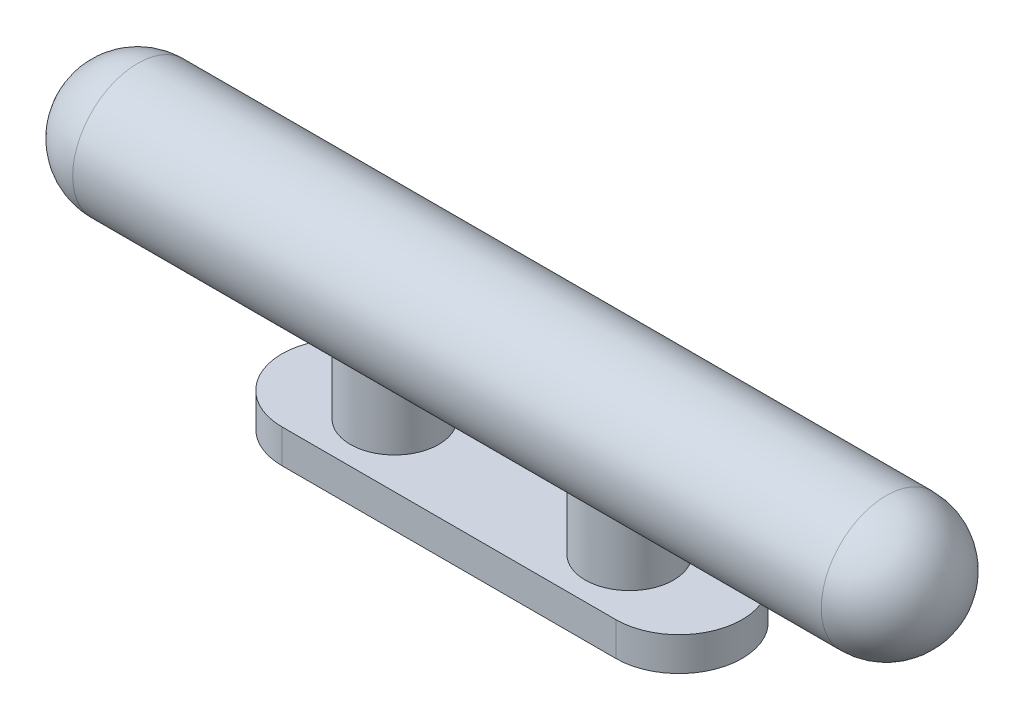
ISO-10303-21;
HEADER;
FILE_DESCRIPTION(('STEP AP214'),'2;1');
FILE_NAME('part.step','',(''),(''),'','','');
FILE_SCHEMA(('AUTOMOTIVE_DESIGN { 1 0 10303 214 1 1 1 1 }'));
ENDSEC;
DATA;
#1=APPLICATION_CONTEXT('core data for automotive mechanical design processes');
#2=APPLICATION_PROTOCOL_DEFINITION('international standard','automotive_design',2000,#1);
#3=PRODUCT_CONTEXT('',#1,'mechanical');
#4=PRODUCT('Part','Part','',(#3));
#5=PRODUCT_RELATED_PRODUCT_CATEGORY('part','',(#4));
#6=PRODUCT_DEFINITION_FORMATION('','',#4);
#7=PRODUCT_DEFINITION_CONTEXT('part definition',#1,'design');
#8=PRODUCT_DEFINITION('design','',#6,#7);
#9=PRODUCT_DEFINITION_SHAPE('','',#8);
#10=(LENGTH_UNIT() NAMED_UNIT(*) SI_UNIT(.MILLI.,.METRE.));
#11=(NAMED_UNIT(*) PLANE_ANGLE_UNIT() SI_UNIT($,.RADIAN.));
#12=(NAMED_UNIT(*) SI_UNIT($,.STERADIAN.) SOLID_ANGLE_UNIT());
#13=UNCERTAINTY_MEASURE_WITH_UNIT(LENGTH_MEASURE(1.E-05),#10,'distance_accuracy_value','');
#14=(GEOMETRIC_REPRESENTATION_CONTEXT(3) GLOBAL_UNCERTAINTY_ASSIGNED_CONTEXT((#13)) GLOBAL_UNIT_ASSIGNED_CONTEXT((#10,
#11,#12)) REPRESENTATION_CONTEXT('',''));
#15=CARTESIAN_POINT('',(0.,0.,0.));
#16=DIRECTION('',(0.,0.,1.));
#17=DIRECTION('',(1.,0.,0.));
#18=AXIS2_PLACEMENT_3D('',#15,#16,#17);
#19=CARTESIAN_POINT('',(0.,5.842,0.));
#20=DIRECTION('',(0.,-1.,0.));
#21=DIRECTION('',(0.,0.,-1.));
#22=AXIS2_PLACEMENT_3D('',#19,#20,#21);
#23=CYLINDRICAL_SURFACE('',#22,10.95375);
#24=CARTESIAN_POINT('',(0.,0.,0.));
#25=DIRECTION('',(0.,1.,0.));
#26=DIRECTION('',(0.,0.,1.));
#27=AXIS2_PLACEMENT_3D('',#24,#25,#26);
#28=CIRCLE('',#27,10.95375);
#29=CARTESIAN_POINT('',(0.,0.,-10.95375));
#30=VERTEX_POINT('',#29);
#31=CARTESIAN_POINT('',(0.,0.,10.95375));
#32=VERTEX_POINT('',#31);
#33=EDGE_CURVE('E104',#30,#32,#28,.T.);
#34=ORIENTED_EDGE('',*,*,#33,.T.);
#35=DIRECTION('',(0.,-1.,0.));
#36=VECTOR('',#35,1.);
#37=CARTESIAN_POINT('',(0.,5.842,10.95375));
#38=LINE('',#37,#36);
#39=CARTESIAN_POINT('',(0.,5.842,10.95375));
#40=VERTEX_POINT('',#39);
#41=EDGE_CURVE('E11',#40,#32,#38,.T.);
#42=ORIENTED_EDGE('',*,*,#41,.F.);
#43=CARTESIAN_POINT('',(0.,5.842,0.));
#44=DIRECTION('',(0.,1.,0.));
#45=DIRECTION('',(0.,0.,1.));
#46=AXIS2_PLACEMENT_3D('',#43,#44,#45);
#47=CIRCLE('',#46,10.95375);
#48=CARTESIAN_POINT('',(0.,5.842,-10.95375));
#49=VERTEX_POINT('',#48);
#50=EDGE_CURVE('E91',#49,#40,#47,.T.);
#51=ORIENTED_EDGE('',*,*,#50,.F.);
#52=DIRECTION('',(0.,-1.,0.));
#53=VECTOR('',#52,1.);
#54=CARTESIAN_POINT('',(0.,5.842,-10.95375));
#55=LINE('',#54,#53);
#56=EDGE_CURVE('E100',#49,#30,#55,.T.);
#57=ORIENTED_EDGE('',*,*,#56,.T.);
#58=EDGE_LOOP('',(#34,#42,#51,#57));
#59=FACE_BOUND('',#58,.T.);
#60=ADVANCED_FACE('F34',(#59),#23,.T.);
#61=CARTESIAN_POINT('',(0.,5.842,10.95375));
#62=DIRECTION('',(0.,0.,-1.));
#63=DIRECTION('',(-1.,0.,0.));
#64=AXIS2_PLACEMENT_3D('',#61,#62,#63);
#65=PLANE('',#64);
#66=DIRECTION('',(1.,0.,0.));
#67=VECTOR('',#66,1.);
#68=CARTESIAN_POINT('',(0.,0.,10.95375));
#69=LINE('',#68,#67);
#70=CARTESIAN_POINT('',(57.9374,0.,10.95375));
#71=VERTEX_POINT('',#70);
#72=EDGE_CURVE('E95',#32,#71,#69,.T.);
#73=ORIENTED_EDGE('',*,*,#72,.T.);
#74=DIRECTION('',(0.,-1.,0.));
#75=VECTOR('',#74,1.);
#76=CARTESIAN_POINT('',(57.9374,5.842,10.95375));
#77=LINE('',#76,#75);
#78=CARTESIAN_POINT('',(57.9374,5.842,10.95375));
#79=VERTEX_POINT('',#78);
#80=EDGE_CURVE('E48',#79,#71,#77,.T.);
#81=ORIENTED_EDGE('',*,*,#80,.F.);
#82=DIRECTION('',(1.,0.,0.));
#83=VECTOR('',#82,1.);
#84=CARTESIAN_POINT('',(0.,5.842,10.95375));
#85=LINE('',#84,#83);
#86=EDGE_CURVE('E86',#40,#79,#85,.T.);
#87=ORIENTED_EDGE('',*,*,#86,.F.);
#88=ORIENTED_EDGE('',*,*,#41,.T.);
#89=EDGE_LOOP('',(#73,#81,#87,#88));
#90=FACE_BOUND('',#89,.T.);
#91=ADVANCED_FACE('F94',(#90),#65,.F.);
#92=CARTESIAN_POINT('',(57.9374,5.842,0.));
#93=DIRECTION('',(0.,-1.,0.));
#94=DIRECTION('',(0.,0.,-1.));
#95=AXIS2_PLACEMENT_3D('',#92,#93,#94);
#96=CYLINDRICAL_SURFACE('',#95,10.95375);
#97=CARTESIAN_POINT('',(57.9374,0.,0.));
#98=DIRECTION('',(0.,1.,0.));
#99=DIRECTION('',(0.,0.,1.));
#100=AXIS2_PLACEMENT_3D('',#97,#98,#99);
#101=CIRCLE('',#100,10.95375);
#102=CARTESIAN_POINT('',(57.9374,0.,-10.95375));
#103=VERTEX_POINT('',#102);
#104=EDGE_CURVE('E73',#71,#103,#101,.T.);
#105=ORIENTED_EDGE('',*,*,#104,.T.);
#106=DIRECTION('',(0.,-1.,0.));
#107=VECTOR('',#106,1.);
#108=CARTESIAN_POINT('',(57.9374,5.842,-10.95375));
#109=LINE('',#108,#107);
#110=CARTESIAN_POINT('',(57.9374,5.842,-10.95375));
#111=VERTEX_POINT('',#110);
#112=EDGE_CURVE('E96',#111,#103,#109,.T.);
#113=ORIENTED_EDGE('',*,*,#112,.F.);
#114=CARTESIAN_POINT('',(57.9374,5.842,0.));
#115=DIRECTION('',(0.,1.,0.));
#116=DIRECTION('',(0.,0.,1.));
#117=AXIS2_PLACEMENT_3D('',#114,#115,#116);
#118=CIRCLE('',#117,10.95375);
#119=EDGE_CURVE('E89',#79,#111,#118,.T.);
#120=ORIENTED_EDGE('',*,*,#119,.F.);
#121=ORIENTED_EDGE('',*,*,#80,.T.);
#122=EDGE_LOOP('',(#105,#113,#120,#121));
#123=FACE_BOUND('',#122,.T.);
#124=ADVANCED_FACE('F98',(#123),#96,.T.);
#125=CARTESIAN_POINT('',(0.,5.842,-10.95375));
#126=DIRECTION('',(0.,0.,1.));
#127=DIRECTION('',(1.,0.,0.));
#128=AXIS2_PLACEMENT_3D('',#125,#126,#127);
#129=PLANE('',#128);
#130=DIRECTION('',(-1.,0.,0.));
#131=VECTOR('',#130,1.);
#132=CARTESIAN_POINT('',(0.,0.,-10.95375));
#133=LINE('',#132,#131);
#134=EDGE_CURVE('E79',#103,#30,#133,.T.);
#135=ORIENTED_EDGE('',*,*,#134,.T.);
#136=ORIENTED_EDGE('',*,*,#56,.F.);
#137=DIRECTION('',(-1.,0.,0.));
#138=VECTOR('',#137,1.);
#139=CARTESIAN_POINT('',(0.,5.842,-10.95375));
#140=LINE('',#139,#138);
#141=EDGE_CURVE('E56',#111,#49,#140,.T.);
#142=ORIENTED_EDGE('',*,*,#141,.F.);
#143=ORIENTED_EDGE('',*,*,#112,.T.);
#144=EDGE_LOOP('',(#135,#136,#142,#143));
#145=FACE_BOUND('',#144,.T.);
#146=ADVANCED_FACE('F112',(#145),#129,.F.);
#147=CARTESIAN_POINT('',(0.,5.842,0.));
#148=DIRECTION('',(0.,1.,0.));
#149=DIRECTION('',(0.,0.,1.));
#150=AXIS2_PLACEMENT_3D('',#147,#148,#149);
#151=PLANE('',#150);
#152=CARTESIAN_POINT('',(49.3395,5.842,0.));
#153=DIRECTION('',(0.,1.,0.));
#154=DIRECTION('',(0.,0.,1.));
#155=AXIS2_PLACEMENT_3D('',#152,#153,#154);
#156=CIRCLE('',#155,7.6708);
#157=CARTESIAN_POINT('',(49.3395,5.842,7.6708));
#158=VERTEX_POINT('',#157);
#159=EDGE_CURVE('E120',#158,#158,#156,.T.);
#160=ORIENTED_EDGE('',*,*,#159,.F.);
#161=EDGE_LOOP('',(#160));
#162=FACE_BOUND('',#161,.T.);
#163=CARTESIAN_POINT('',(8.59790000000001,5.842,0.));
#164=DIRECTION('',(0.,1.,0.));
#165=DIRECTION('',(0.,0.,1.));
#166=AXIS2_PLACEMENT_3D('',#163,#164,#165);
#167=CIRCLE('',#166,7.6708);
#168=CARTESIAN_POINT('',(8.59790000000001,5.842,7.6708));
#169=VERTEX_POINT('',#168);
#170=EDGE_CURVE('E107',#169,#169,#167,.T.);
#171=ORIENTED_EDGE('',*,*,#170,.F.);
#172=EDGE_LOOP('',(#171));
#173=FACE_BOUND('',#172,.T.);
#174=ORIENTED_EDGE('',*,*,#50,.T.);
#175=ORIENTED_EDGE('',*,*,#86,.T.);
#176=ORIENTED_EDGE('',*,*,#119,.T.);
#177=ORIENTED_EDGE('',*,*,#141,.T.);
#178=EDGE_LOOP('',(#174,#175,#176,#177));
#179=FACE_BOUND('',#178,.T.);
#180=ADVANCED_FACE('F87',(#162,#173,#179),#151,.T.);
#181=CARTESIAN_POINT('',(0.,0.,0.));
#182=DIRECTION('',(0.,1.,0.));
#183=DIRECTION('',(0.,0.,1.));
#184=AXIS2_PLACEMENT_3D('',#181,#182,#183);
#185=PLANE('',#184);
#186=ORIENTED_EDGE('',*,*,#33,.F.);
#187=ORIENTED_EDGE('',*,*,#134,.F.);
#188=ORIENTED_EDGE('',*,*,#104,.F.);
#189=ORIENTED_EDGE('',*,*,#72,.F.);
#190=EDGE_LOOP('',(#186,#187,#188,#189));
#191=FACE_BOUND('',#190,.T.);
#192=ADVANCED_FACE('F115',(#191),#185,.F.);
#193=CARTESIAN_POINT('',(8.59790000000001,20.066,0.));
#194=DIRECTION('',(0.,-1.,0.));
#195=DIRECTION('',(0.,0.,-1.));
#196=AXIS2_PLACEMENT_3D('',#193,#194,#195);
#197=CYLINDRICAL_SURFACE('',#196,7.6708);
#198=CARTESIAN_POINT('',(8.59790000000001,17.4378120890375,-7.6708));
#199=CARTESIAN_POINT('',(8.78391783777506,17.4378244508428,-7.67080699652784));
#200=CARTESIAN_POINT('',(8.96988057077858,17.4315108332895,-7.66402404958843));
#201=CARTESIAN_POINT('',(9.34006679489015,17.4066172668826,-7.63706631006754));
#202=CARTESIAN_POINT('',(9.52428980382832,17.3880340131268,-7.61688790932998));
#203=CARTESIAN_POINT('',(9.88958505340738,17.3394734207738,-7.56352165721397));
#204=CARTESIAN_POINT('',(10.0706520101718,17.3094785952447,-7.53031383728009));
#205=CARTESIAN_POINT('',(10.4281283094633,17.239456072443,-7.45150886924623));
#206=CARTESIAN_POINT('',(10.6045351418983,17.1994230853655,-7.40590518783713));
#207=CARTESIAN_POINT('',(11.1214451270384,17.0675960254109,-7.25265468603863));
#208=CARTESIAN_POINT('',(11.453862877673,16.963447252862,-7.12792506308041));
#209=CARTESIAN_POINT('',(12.0923137419647,16.734584788211,-6.83765431745398));
#210=CARTESIAN_POINT('',(12.3983430127737,16.6098681085637,-6.67210726420966));
#211=CARTESIAN_POINT('',(12.8601359315492,16.4049773656264,-6.38081549351292));
#212=CARTESIAN_POINT('',(13.0252372109906,16.3279770360541,-6.26736100232386));
#213=CARTESIAN_POINT('',(13.3456877770527,16.1724909104095,-6.02823869905463));
#214=CARTESIAN_POINT('',(13.5010354937534,16.0940048778332,-5.9025689290728));
#215=CARTESIAN_POINT('',(13.8016889327219,15.9371979271996,-5.63930133699415));
#216=CARTESIAN_POINT('',(13.9469838234186,15.8588772727505,-5.50169099830054));
#217=CARTESIAN_POINT('',(14.226845680076,15.7040734317296,-5.21500433098464));
#218=CARTESIAN_POINT('',(14.3614127204771,15.6275902324104,-5.06592808193813));
#219=CARTESIAN_POINT('',(14.6390013200792,15.4664736574273,-4.73288473973089));
#220=CARTESIAN_POINT('',(14.7801458271726,15.3823932677157,-4.54707583867427));
#221=CARTESIAN_POINT('',(15.0461187339326,15.220933843764,-4.16131411175745));
#222=CARTESIAN_POINT('',(15.1709443584324,15.1435559500942,-3.96135888908054));
#223=CARTESIAN_POINT('',(15.402644819705,14.997814228172,-3.54859766258549));
#224=CARTESIAN_POINT('',(15.5095466485863,14.9294368796582,-3.3358116503376));
#225=CARTESIAN_POINT('',(15.7040243900977,14.8036721363964,-2.89851154543221));
#226=CARTESIAN_POINT('',(15.7916080854617,14.7462803171232,-2.67400222101776));
#227=CARTESIAN_POINT('',(15.926073544578,14.6574756229764,-2.27407732698637));
#228=CARTESIAN_POINT('',(15.9776318167203,14.6231760745183,-2.10085897881962));
#229=CARTESIAN_POINT('',(16.0686242465224,14.5623738497616,-1.74993902694193));
#230=CARTESIAN_POINT('',(16.1080608473353,14.5358696023473,-1.57223833448167));
#231=CARTESIAN_POINT('',(16.1742885746988,14.4912298681964,-1.21356803208836));
#232=CARTESIAN_POINT('',(16.2010873716688,14.4730893053346,-1.03260047439206));
#233=CARTESIAN_POINT('',(16.2417059334351,14.4455533712019,-0.668541998758356));
#234=CARTESIAN_POINT('',(16.255525267924,14.4361582898695,-0.485451010626671));
#235=CARTESIAN_POINT('',(16.2699943896594,14.426320801703,-0.118192822142079));
#236=CARTESIAN_POINT('',(16.270621581741,14.4258937550919,0.0659756843420753));
#237=CARTESIAN_POINT('',(16.2586397271341,14.4340412320798,0.433679045673226));
#238=CARTESIAN_POINT('',(16.2460307295535,14.442615722282,0.617213902868604));
#239=CARTESIAN_POINT('',(16.2077559509117,14.4685729109127,0.982327602765214));
#240=CARTESIAN_POINT('',(16.1820870003027,14.4859577475388,1.1639059597101));
#241=CARTESIAN_POINT('',(16.1180509823832,14.5291477867394,1.52378164580875));
#242=CARTESIAN_POINT('',(16.0796838735248,14.554953016865,1.70207896422505));
#243=CARTESIAN_POINT('',(15.9915877442089,14.6138733455215,2.05092606010043));
#244=CARTESIAN_POINT('',(15.9420871953193,14.6468410526301,2.22155857856856));
#245=CARTESIAN_POINT('',(15.8319020019557,14.7197111372412,2.55767674890843));
#246=CARTESIAN_POINT('',(15.7712134280901,14.7596159508712,2.72316056854425));
#247=CARTESIAN_POINT('',(15.5732963913517,14.8886476835287,3.21057662193735));
#248=CARTESIAN_POINT('',(15.4201494306545,14.9871377290398,3.52373510353359));
#249=CARTESIAN_POINT('',(15.0571585353707,15.2146670999225,4.15531472228306));
#250=CARTESIAN_POINT('',(14.8428698309037,15.3458984481079,4.47035089940743));
#251=CARTESIAN_POINT('',(14.3734801506955,15.6219311275084,5.06228089297152));
#252=CARTESIAN_POINT('',(14.1183322081206,15.7667479946737,5.33913012429843));
#253=CARTESIAN_POINT('',(13.6851753173128,15.9988573204029,5.74533469764518));
#254=CARTESIAN_POINT('',(13.5190629407839,16.0850969631792,5.88824017437575));
#255=CARTESIAN_POINT('',(13.1748264331921,16.256570316435,6.15962224181759));
#256=CARTESIAN_POINT('',(12.9966999104407,16.3418038226284,6.2880959459079));
#257=CARTESIAN_POINT('',(12.6290519421525,16.5087971550379,6.52988370466521));
#258=CARTESIAN_POINT('',(12.4395364227847,16.5905587506753,6.64320554615663));
#259=CARTESIAN_POINT('',(12.0494085781452,16.7480058477181,6.85400626053418));
#260=CARTESIAN_POINT('',(11.8487958925653,16.8236911516398,6.95148461860121));
#261=CARTESIAN_POINT('',(11.4859029432692,16.9491196103205,7.10843836040414));
#262=CARTESIAN_POINT('',(11.3258004564318,17.0007608754842,7.17144600337549));
#263=CARTESIAN_POINT('',(10.9999032263718,17.0973323075269,7.2870732419378));
#264=CARTESIAN_POINT('',(10.8341090220252,17.1422631075905,7.33969381778053));
#265=CARTESIAN_POINT('',(10.4976632270672,17.2239034680759,7.43387799770965));
#266=CARTESIAN_POINT('',(10.3270185261839,17.2606240912278,7.47545649471679));
#267=CARTESIAN_POINT('',(9.98161749761212,17.3245263012489,7.54702474052248));
#268=CARTESIAN_POINT('',(9.80686304059125,17.3517121417742,7.57701965759181));
#269=CARTESIAN_POINT('',(9.45281964332377,17.3955961140441,7.62512101751529));
#270=CARTESIAN_POINT('',(9.2735044067435,17.4122004025382,7.64312114609447));
#271=CARTESIAN_POINT('',(8.91334598111197,17.4337485090152,7.66643500975236));
#272=CARTESIAN_POINT('',(8.73250282408875,17.4386925708124,7.67174901009685));
#273=CARTESIAN_POINT('',(8.37096130156885,17.436673779161,7.66957311827002));
#274=CARTESIAN_POINT('',(8.19026293675336,17.4297108700218,7.66208316621256));
#275=CARTESIAN_POINT('',(7.83067201995542,17.4042243051856,7.63446489830316));
#276=CARTESIAN_POINT('',(7.65177942774901,17.3857009075811,7.61433686460129));
#277=CARTESIAN_POINT('',(7.317630800514,17.3407109425091,7.56486932005861));
#278=CARTESIAN_POINT('',(7.16201904846551,17.3154004604431,7.53685265578874));
#279=CARTESIAN_POINT('',(6.85415368946296,17.2572643672017,7.4716336452798));
#280=CARTESIAN_POINT('',(6.70190106683286,17.2244365844773,7.43442864452962));
#281=CARTESIAN_POINT('',(6.25101295134023,17.1160902405112,7.30961528565452));
#282=CARTESIAN_POINT('',(5.95826119877356,17.0307107150826,7.20881069470269));
#283=CARTESIAN_POINT('',(5.46943082300102,16.8677996188517,7.00739380595435));
#284=CARTESIAN_POINT('',(5.26874276373073,16.7944665789651,6.91421042470014));
#285=CARTESIAN_POINT('',(4.87804803456972,16.641238817754,6.71209354337536));
#286=CARTESIAN_POINT('',(4.68804184195148,16.5613438036281,6.60315934032373));
#287=CARTESIAN_POINT('',(4.31889680664309,16.3975161961335,6.37016870438613));
#288=CARTESIAN_POINT('',(4.13977767005661,16.3135767470372,6.24608600530307));
#289=CARTESIAN_POINT('',(3.79318889976585,16.1441779698151,5.98357496332808));
#290=CARTESIAN_POINT('',(3.62571799134708,16.0587188092871,5.84514819430896));
#291=CARTESIAN_POINT('',(3.30061669501591,15.8872157986158,5.5523419856699));
#292=CARTESIAN_POINT('',(3.14316153471463,15.80118109628,5.39776251501983));
#293=CARTESIAN_POINT('',(2.84145817076475,15.6318596384744,5.0747790563024));
#294=CARTESIAN_POINT('',(2.69721094347248,15.5485730864441,4.90637404796654));
#295=CARTESIAN_POINT('',(2.42304642369599,15.3868703662527,4.55649870730448));
#296=CARTESIAN_POINT('',(2.29310969204769,15.3084476560389,4.37504666617186));
#297=CARTESIAN_POINT('',(2.04847319928764,15.158295472087,3.99954544890088));
#298=CARTESIAN_POINT('',(1.93377019562638,15.0865645749446,3.80549896666401));
#299=CARTESIAN_POINT('',(1.73955202480074,14.9635047743986,3.44080083823092));
#300=CARTESIAN_POINT('',(1.65739376782734,14.9108041742472,3.27201561286906));
#301=CARTESIAN_POINT('',(1.50507478985128,14.8122389793783,2.92720201477177));
#302=CARTESIAN_POINT('',(1.43491188235086,14.7663731390251,2.75117496933935));
#303=CARTESIAN_POINT('',(1.30737498248268,14.6824345611307,2.39281653777666));
#304=CARTESIAN_POINT('',(1.24999559204476,14.6443585347574,2.21048785034182));
#305=CARTESIAN_POINT('',(1.14871681674962,14.5768175090027,1.84054774295252));
#306=CARTESIAN_POINT('',(1.10481759716043,14.5473526151947,1.65293625826131));
#307=CARTESIAN_POINT('',(1.03094396799824,14.4976075685807,1.27280019146328));
#308=CARTESIAN_POINT('',(1.00103958387855,14.4773736167271,1.08025588179277));
#309=CARTESIAN_POINT('',(0.955946667104487,14.4468133126343,0.692664331522153));
#310=CARTESIAN_POINT('',(0.940758167585025,14.4364869827035,0.497617085287325));
#311=CARTESIAN_POINT('',(0.925348381933485,14.4260099269057,0.106691840211141));
#312=CARTESIAN_POINT('',(0.925124504913871,14.4258574395988,-0.0891860089515206));
#313=CARTESIAN_POINT('',(0.939642218285522,14.4357285056236,-0.480119907148693));
#314=CARTESIAN_POINT('',(0.954382974039657,14.4457514914287,-0.675176001406492));
#315=CARTESIAN_POINT('',(0.996767509027684,14.4744800673243,-1.0469174177553));
#316=CARTESIAN_POINT('',(1.02325364305866,14.4924059654819,-1.22379715874692));
#317=CARTESIAN_POINT('',(1.08828628222069,14.536236537537,-1.57437877591684));
#318=CARTESIAN_POINT('',(1.12683685798433,14.5621439043955,-1.74807955852152));
#319=CARTESIAN_POINT('',(1.21551082159655,14.6214037625205,-2.09114493729748));
#320=CARTESIAN_POINT('',(1.26563133887468,14.6547544069981,-2.26051059747849));
#321=CARTESIAN_POINT('',(1.37691055700861,14.7282780454665,-2.59411288176678));
#322=CARTESIAN_POINT('',(1.43807350574839,14.7684536645863,-2.75834750340733));
#323=CARTESIAN_POINT('',(1.57411776965873,14.8570441900436,-3.0888747223249));
#324=CARTESIAN_POINT('',(1.649528282047,14.9057685022306,-3.25486676870612));
#325=CARTESIAN_POINT('',(1.81113131946051,15.0090312368388,-3.57964922164404));
#326=CARTESIAN_POINT('',(1.8973277510332,15.0635717647697,-3.73843699034887));
#327=CARTESIAN_POINT('',(2.1710835968773,15.234526888212,-4.20313117977442));
#328=CARTESIAN_POINT('',(2.37390070821064,15.3583356041778,-4.49758729441865));
#329=CARTESIAN_POINT('',(2.72206293302045,15.5629098576526,-4.93537205588274));
#330=CARTESIAN_POINT('',(2.85567660299952,15.6398635867521,-5.09015305635029));
#331=CARTESIAN_POINT('',(3.1342056244277,15.7961300888186,-5.3880193714035));
#332=CARTESIAN_POINT('',(3.27912215185362,15.8754431067192,-5.53110346583419));
#333=CARTESIAN_POINT('',(3.57996410539259,16.034925949675,-5.80543215323835));
#334=CARTESIAN_POINT('',(3.73591285524509,16.1150972662846,-5.93665024044172));
#335=CARTESIAN_POINT('',(4.05809934354786,16.2743563005425,-6.18651257713947));
#336=CARTESIAN_POINT('',(4.22433705629672,16.3534440208968,-6.30515685804073));
#337=CARTESIAN_POINT('',(4.58947636729403,16.5189058455737,-6.54426838489126));
#338=CARTESIAN_POINT('',(4.78978605541728,16.6048552761818,-6.66289068212313));
#339=CARTESIAN_POINT('',(5.20271249096656,16.7697812266295,-6.88248265099443));
#340=CARTESIAN_POINT('',(5.41533280320543,16.8487557098312,-6.98344717506274));
#341=CARTESIAN_POINT('',(5.85134230137828,16.9959111084492,-7.16611710978134));
#342=CARTESIAN_POINT('',(6.0746892397634,17.0641304582244,-7.2478916342091));
#343=CARTESIAN_POINT('',(6.53143382484556,17.1862885944204,-7.39108224638992));
#344=CARTESIAN_POINT('',(6.76482222213395,17.2402402090518,-7.45251663469818));
#345=CARTESIAN_POINT('',(7.26149741890973,17.3343507521987,-7.5581318168456));
#346=CARTESIAN_POINT('',(7.52556727627752,17.3727984330937,-7.60022254842226));
#347=CARTESIAN_POINT('',(8.05909850276498,17.4245136525205,-7.65654438363255));
#348=CARTESIAN_POINT('',(8.32855701592809,17.4377941898641,-7.67078986943559));
#349=CARTESIAN_POINT('',(8.59790000000001,17.4378120890375,-7.6708));
#350=B_SPLINE_CURVE_WITH_KNOTS('',3,(#198,#199,#200,#201,#202,#203,#204,#205,#206,#207,#208,
#209,#210,#211,#212,#213,#214,#215,#216,#217,#218,#219,#220,#221,#222,#223,#224,#225,#226,#227,
#228,#229,#230,#231,#232,#233,#234,#235,#236,#237,#238,#239,#240,#241,#242,#243,#244,#245,#246,
#247,#248,#249,#250,#251,#252,#253,#254,#255,#256,#257,#258,#259,#260,#261,#262,#263,#264,#265,
#266,#267,#268,#269,#270,#271,#272,#273,#274,#275,#276,#277,#278,#279,#280,#281,#282,#283,#284,
#285,#286,#287,#288,#289,#290,#291,#292,#293,#294,#295,#296,#297,#298,#299,#300,#301,#302,#303,
#304,#305,#306,#307,#308,#309,#310,#311,#312,#313,#314,#315,#316,#317,#318,#319,#320,#321,#322,
#323,#324,#325,#326,#327,#328,#329,#330,#331,#332,#333,#334,#335,#336,#337,#338,#339,#340,#341,
#342,#343,#344,#345,#346,#347,#348,#349),.UNSPECIFIED.,.T.,.F.,(4,2,2,2,2,2,2,2,2,2,2,2,2,2,2,2,
2,2,2,2,2,2,2,2,2,2,2,2,2,2,2,2,2,2,2,2,2,2,2,2,2,2,2,2,2,2,2,2,2,2,2,2,2,2,2,2,2,2,2,2,2,2,2,2,
2,2,2,2,2,2,2,2,2,2,2,4),(0.,0.557731940959318,1.11561417177753,1.67435475945509,2.233390407464,
3.33867218950612,4.44411465840308,5.08745348187659,5.73089559220631,6.37502052718347,
7.01914099220382,7.76221464378557,8.50541449753439,9.2474848859514,9.98925576674997,
10.5405516275118,11.091736300249,11.642586003688,12.1934539687756,12.7452653697701,
13.2970747234846,13.8490180609105,14.4009632042925,14.9424754504482,15.4841782469011,
16.5667705171967,17.7713799618863,18.9773841523958,19.6831977242891,20.3891522214918,
21.0947425094916,21.8003557204025,22.3388089039126,22.877211248019,23.4148836950295,
23.9523159696431,24.4944505012943,25.0365736968624,25.5786994280345,26.1208130564699,
26.6006880886897,27.0807019193537,28.0407720402815,28.7392941653186,29.4378474759972,
30.1376296957959,30.8373352146063,31.5470590522169,32.2568353117227,32.9656352100752,
33.6742839953909,34.2586357202767,34.8428808164101,35.4268787349533,36.0108838130741,
36.5977806112053,37.1846787308152,37.7714752380414,38.3582390190889,38.8968697703167,
39.4356824558731,39.9743616022444,40.5132484149422,41.078810307319,41.6445776364591,
42.7753851649144,43.4303259257313,44.0853349193102,44.7417726557061,45.3982087524122,
46.1417011183814,46.8854098663063,47.6263975275672,48.3667166794677,49.1746974490034,
49.9822607831815),.UNSPECIFIED.);
#351=CARTESIAN_POINT('',(8.59790000000001,17.4378120890375,-7.6708));
#352=VERTEX_POINT('',#351);
#353=EDGE_CURVE('E123',#352,#352,#350,.T.);
#354=ORIENTED_EDGE('',*,*,#353,.T.);
#355=EDGE_LOOP('',(#354));
#356=FACE_BOUND('',#355,.T.);
#357=ORIENTED_EDGE('',*,*,#170,.T.);
#358=EDGE_LOOP('',(#357));
#359=FACE_BOUND('',#358,.T.);
#360=ADVANCED_FACE('F132',(#356,#359),#197,.T.);
#361=CARTESIAN_POINT('',(49.3395,20.066,0.));
#362=DIRECTION('',(0.,-1.,0.));
#363=DIRECTION('',(0.,0.,-1.));
#364=AXIS2_PLACEMENT_3D('',#361,#362,#363);
#365=CYLINDRICAL_SURFACE('',#364,7.6708);
#366=CARTESIAN_POINT('',(49.3395,17.4378120890375,-7.6708));
#367=CARTESIAN_POINT('',(49.5255178377751,17.4378244508428,-7.67080699652784));
#368=CARTESIAN_POINT('',(49.7114805707786,17.4315108332895,-7.66402404958843));
#369=CARTESIAN_POINT('',(50.0816667948901,17.4066172668826,-7.63706631006754));
#370=CARTESIAN_POINT('',(50.2658898038283,17.3880340131268,-7.61688790932998));
#371=CARTESIAN_POINT('',(50.6311850534074,17.3394734207738,-7.56352165721397));
#372=CARTESIAN_POINT('',(50.8122520101718,17.3094785952447,-7.53031383728009));
#373=CARTESIAN_POINT('',(51.1697283094633,17.239456072443,-7.45150886924623));
#374=CARTESIAN_POINT('',(51.3461351418983,17.1994230853655,-7.40590518783713));
#375=CARTESIAN_POINT('',(51.8630451270384,17.0675960254109,-7.25265468603863));
#376=CARTESIAN_POINT('',(52.195462877673,16.963447252862,-7.12792506308041));
#377=CARTESIAN_POINT('',(52.8339137419647,16.734584788211,-6.83765431745398));
#378=CARTESIAN_POINT('',(53.1399430127737,16.6098681085637,-6.67210726420966));
#379=CARTESIAN_POINT('',(53.6017359315492,16.4049773656264,-6.38081549351292));
#380=CARTESIAN_POINT('',(53.7668372109906,16.3279770360541,-6.26736100232386));
#381=CARTESIAN_POINT('',(54.0872877770527,16.1724909104095,-6.02823869905464));
#382=CARTESIAN_POINT('',(54.2426354937534,16.0940048778332,-5.90256892907281));
#383=CARTESIAN_POINT('',(54.5432889327219,15.9371979271996,-5.63930133699415));
#384=CARTESIAN_POINT('',(54.6885838234185,15.8588772727505,-5.50169099830055));
#385=CARTESIAN_POINT('',(54.968445680076,15.7040734317296,-5.21500433098464));
#386=CARTESIAN_POINT('',(55.1030127204771,15.6275902324104,-5.06592808193813));
#387=CARTESIAN_POINT('',(55.3806013200792,15.4664736574273,-4.73288473973089));
#388=CARTESIAN_POINT('',(55.5217458271726,15.3823932677157,-4.54707583867427));
#389=CARTESIAN_POINT('',(55.7877187339327,15.220933843764,-4.16131411175745));
#390=CARTESIAN_POINT('',(55.9125443584324,15.1435559500942,-3.96135888908054));
#391=CARTESIAN_POINT('',(56.144244819705,14.997814228172,-3.5485976625855));
#392=CARTESIAN_POINT('',(56.2511466485863,14.9294368796582,-3.3358116503376));
#393=CARTESIAN_POINT('',(56.4456243900977,14.8036721363964,-2.89851154543221));
#394=CARTESIAN_POINT('',(56.5332080854617,14.7462803171232,-2.67400222101777));
#395=CARTESIAN_POINT('',(56.667673544578,14.6574756229764,-2.27407732698637));
#396=CARTESIAN_POINT('',(56.7192318167203,14.6231760745183,-2.10085897881963));
#397=CARTESIAN_POINT('',(56.8102242465224,14.5623738497616,-1.74993902694193));
#398=CARTESIAN_POINT('',(56.8496608473353,14.5358696023473,-1.57223833448168));
#399=CARTESIAN_POINT('',(56.9158885746988,14.4912298681964,-1.21356803208836));
#400=CARTESIAN_POINT('',(56.9426873716688,14.4730893053346,-1.03260047439206));
#401=CARTESIAN_POINT('',(56.9833059334351,14.4455533712019,-0.668541998758361));
#402=CARTESIAN_POINT('',(56.997125267924,14.4361582898695,-0.485451010626677));
#403=CARTESIAN_POINT('',(57.0115943896594,14.426320801703,-0.118192822142086));
#404=CARTESIAN_POINT('',(57.012221581741,14.4258937550919,0.0659756843420689));
#405=CARTESIAN_POINT('',(57.0002397271341,14.4340412320798,0.43367904567322));
#406=CARTESIAN_POINT('',(56.9876307295536,14.442615722282,0.617213902868596));
#407=CARTESIAN_POINT('',(56.9493559509118,14.4685729109127,0.982327602765207));
#408=CARTESIAN_POINT('',(56.9236870003027,14.4859577475388,1.1639059597101));
#409=CARTESIAN_POINT('',(56.8596509823832,14.5291477867394,1.52378164580874));
#410=CARTESIAN_POINT('',(56.8212838735248,14.554953016865,1.70207896422505));
#411=CARTESIAN_POINT('',(56.7331877442089,14.6138733455215,2.05092606010043));
#412=CARTESIAN_POINT('',(56.6836871953193,14.6468410526301,2.22155857856855));
#413=CARTESIAN_POINT('',(56.5735020019557,14.7197111372412,2.55767674890842));
#414=CARTESIAN_POINT('',(56.5128134280901,14.7596159508712,2.72316056854425));
#415=CARTESIAN_POINT('',(56.3148963913517,14.8886476835287,3.21057662193734));
#416=CARTESIAN_POINT('',(56.1617494306545,14.9871377290398,3.52373510353359));
#417=CARTESIAN_POINT('',(55.7987585353707,15.2146670999225,4.15531472228306));
#418=CARTESIAN_POINT('',(55.5844698309037,15.3458984481079,4.47035089940742));
#419=CARTESIAN_POINT('',(55.1150801506955,15.6219311275084,5.06228089297152));
#420=CARTESIAN_POINT('',(54.8599322081206,15.7667479946737,5.33913012429843));
#421=CARTESIAN_POINT('',(54.4267753173128,15.9988573204029,5.74533469764517));
#422=CARTESIAN_POINT('',(54.2606629407839,16.0850969631792,5.88824017437574));
#423=CARTESIAN_POINT('',(53.9164264331921,16.256570316435,6.15962224181759));
#424=CARTESIAN_POINT('',(53.7382999104407,16.3418038226284,6.28809594590789));
#425=CARTESIAN_POINT('',(53.3706519421526,16.5087971550379,6.5298837046652));
#426=CARTESIAN_POINT('',(53.1811364227847,16.5905587506753,6.64320554615662));
#427=CARTESIAN_POINT('',(52.7910085781452,16.7480058477181,6.85400626053417));
#428=CARTESIAN_POINT('',(52.5903958925653,16.8236911516398,6.9514846186012));
#429=CARTESIAN_POINT('',(52.2275029432692,16.9491196103205,7.10843836040413));
#430=CARTESIAN_POINT('',(52.0674004564318,17.0007608754842,7.17144600337549));
#431=CARTESIAN_POINT('',(51.7415032263718,17.0973323075269,7.2870732419378));
#432=CARTESIAN_POINT('',(51.5757090220252,17.1422631075905,7.33969381778053));
#433=CARTESIAN_POINT('',(51.2392632270672,17.2239034680759,7.43387799770964));
#434=CARTESIAN_POINT('',(51.0686185261839,17.2606240912278,7.47545649471679));
#435=CARTESIAN_POINT('',(50.7232174976121,17.3245263012489,7.54702474052248));
#436=CARTESIAN_POINT('',(50.5484630405913,17.3517121417742,7.57701965759181));
#437=CARTESIAN_POINT('',(50.1944196433238,17.3955961140441,7.62512101751529));
#438=CARTESIAN_POINT('',(50.0151044067435,17.4122004025382,7.64312114609447));
#439=CARTESIAN_POINT('',(49.654945981112,17.4337485090152,7.66643500975236));
#440=CARTESIAN_POINT('',(49.4741028240888,17.4386925708124,7.67174901009685));
#441=CARTESIAN_POINT('',(49.1125613015689,17.436673779161,7.66957311827002));
#442=CARTESIAN_POINT('',(48.9318629367534,17.4297108700218,7.66208316621256));
#443=CARTESIAN_POINT('',(48.5722720199554,17.4042243051856,7.63446489830316));
#444=CARTESIAN_POINT('',(48.393379427749,17.3857009075811,7.61433686460129));
#445=CARTESIAN_POINT('',(48.059230800514,17.3407109425091,7.56486932005861));
#446=CARTESIAN_POINT('',(47.9036190484655,17.3154004604431,7.53685265578874));
#447=CARTESIAN_POINT('',(47.595753689463,17.2572643672017,7.47163364527981));
#448=CARTESIAN_POINT('',(47.4435010668329,17.2244365844773,7.43442864452962));
#449=CARTESIAN_POINT('',(46.9926129513402,17.1160902405112,7.30961528565451));
#450=CARTESIAN_POINT('',(46.6998611987736,17.0307107150826,7.20881069470269));
#451=CARTESIAN_POINT('',(46.211030823001,16.8677996188517,7.00739380595435));
#452=CARTESIAN_POINT('',(46.0103427637307,16.7944665789651,6.91421042470014));
#453=CARTESIAN_POINT('',(45.6196480345697,16.641238817754,6.71209354337536));
#454=CARTESIAN_POINT('',(45.4296418419515,16.5613438036281,6.60315934032373));
#455=CARTESIAN_POINT('',(45.0604968066431,16.3975161961335,6.37016870438612));
#456=CARTESIAN_POINT('',(44.8813776700566,16.3135767470372,6.24608600530307));
#457=CARTESIAN_POINT('',(44.5347888997658,16.1441779698151,5.98357496332807));
#458=CARTESIAN_POINT('',(44.3673179913471,16.0587188092871,5.84514819430896));
#459=CARTESIAN_POINT('',(44.0422166950159,15.8872157986158,5.5523419856699));
#460=CARTESIAN_POINT('',(43.8847615347146,15.80118109628,5.39776251501982));
#461=CARTESIAN_POINT('',(43.5830581707647,15.6318596384744,5.07477905630239));
#462=CARTESIAN_POINT('',(43.4388109434725,15.5485730864441,4.90637404796653));
#463=CARTESIAN_POINT('',(43.164646423696,15.3868703662527,4.55649870730447));
#464=CARTESIAN_POINT('',(43.0347096920477,15.3084476560389,4.37504666617185));
#465=CARTESIAN_POINT('',(42.7900731992876,15.158295472087,3.99954544890087));
#466=CARTESIAN_POINT('',(42.6753701956264,15.0865645749446,3.80549896666401));
#467=CARTESIAN_POINT('',(42.4811520248007,14.9635047743986,3.44080083823092));
#468=CARTESIAN_POINT('',(42.3989937678273,14.9108041742472,3.27201561286906));
#469=CARTESIAN_POINT('',(42.2466747898513,14.8122389793783,2.92720201477176));
#470=CARTESIAN_POINT('',(42.1765118823509,14.7663731390251,2.75117496933935));
#471=CARTESIAN_POINT('',(42.0489749824827,14.6824345611307,2.39281653777666));
#472=CARTESIAN_POINT('',(41.9915955920448,14.6443585347574,2.21048785034182));
#473=CARTESIAN_POINT('',(41.8903168167496,14.5768175090027,1.84054774295252));
#474=CARTESIAN_POINT('',(41.8464175971604,14.5473526151947,1.65293625826131));
#475=CARTESIAN_POINT('',(41.7725439679982,14.4976075685807,1.27280019146328));
#476=CARTESIAN_POINT('',(41.7426395838786,14.4773736167271,1.08025588179277));
#477=CARTESIAN_POINT('',(41.6975466671045,14.4468133126343,0.692664331522153));
#478=CARTESIAN_POINT('',(41.682358167585,14.4364869827035,0.497617085287325));
#479=CARTESIAN_POINT('',(41.6669483819335,14.4260099269057,0.106691840211141));
#480=CARTESIAN_POINT('',(41.6667245049139,14.4258574395988,-0.0891860089515207));
#481=CARTESIAN_POINT('',(41.6812422182855,14.4357285056236,-0.480119907148694));
#482=CARTESIAN_POINT('',(41.6959829740397,14.4457514914287,-0.675176001406494));
#483=CARTESIAN_POINT('',(41.7383675090277,14.4744800673243,-1.0469174177553));
#484=CARTESIAN_POINT('',(41.7648536430587,14.4924059654819,-1.22379715874692));
#485=CARTESIAN_POINT('',(41.8298862822207,14.536236537537,-1.57437877591684));
#486=CARTESIAN_POINT('',(41.8684368579843,14.5621439043955,-1.74807955852152));
#487=CARTESIAN_POINT('',(41.9571108215965,14.6214037625205,-2.09114493729748));
#488=CARTESIAN_POINT('',(42.0072313388747,14.6547544069981,-2.26051059747849));
#489=CARTESIAN_POINT('',(42.1185105570086,14.7282780454665,-2.59411288176678));
#490=CARTESIAN_POINT('',(42.1796735057484,14.7684536645863,-2.75834750340733));
#491=CARTESIAN_POINT('',(42.3157177696587,14.8570441900436,-3.0888747223249));
#492=CARTESIAN_POINT('',(42.391128282047,14.9057685022306,-3.25486676870612));
#493=CARTESIAN_POINT('',(42.5527313194605,15.0090312368388,-3.57964922164405));
#494=CARTESIAN_POINT('',(42.6389277510332,15.0635717647697,-3.73843699034887));
#495=CARTESIAN_POINT('',(42.9126835968773,15.234526888212,-4.20313117977442));
#496=CARTESIAN_POINT('',(43.1155007082107,15.3583356041778,-4.49758729441865));
#497=CARTESIAN_POINT('',(43.4636629330205,15.5629098576526,-4.93537205588275));
#498=CARTESIAN_POINT('',(43.5972766029995,15.6398635867521,-5.09015305635029));
#499=CARTESIAN_POINT('',(43.8758056244277,15.7961300888186,-5.3880193714035));
#500=CARTESIAN_POINT('',(44.0207221518536,15.8754431067192,-5.53110346583419));
#501=CARTESIAN_POINT('',(44.3215641053926,16.034925949675,-5.80543215323835));
#502=CARTESIAN_POINT('',(44.4775128552451,16.1150972662846,-5.93665024044172));
#503=CARTESIAN_POINT('',(44.7996993435479,16.2743563005425,-6.18651257713947));
#504=CARTESIAN_POINT('',(44.9659370562967,16.3534440208968,-6.30515685804072));
#505=CARTESIAN_POINT('',(45.331076367294,16.5189058455737,-6.54426838489125));
#506=CARTESIAN_POINT('',(45.5313860554173,16.6048552761818,-6.66289068212313));
#507=CARTESIAN_POINT('',(45.9443124909666,16.7697812266295,-6.88248265099444));
#508=CARTESIAN_POINT('',(46.1569328032054,16.8487557098312,-6.98344717506274));
#509=CARTESIAN_POINT('',(46.5929423013783,16.9959111084492,-7.16611710978135));
#510=CARTESIAN_POINT('',(46.8162892397634,17.0641304582244,-7.24789163420911));
#511=CARTESIAN_POINT('',(47.2730338248456,17.1862885944204,-7.39108224638993));
#512=CARTESIAN_POINT('',(47.506422222134,17.2402402090518,-7.45251663469818));
#513=CARTESIAN_POINT('',(48.0030974189097,17.3343507521987,-7.5581318168456));
#514=CARTESIAN_POINT('',(48.2671672762775,17.3727984330937,-7.60022254842226));
#515=CARTESIAN_POINT('',(48.800698502765,17.4245136525205,-7.65654438363255));
#516=CARTESIAN_POINT('',(49.0701570159281,17.4377941898641,-7.67078986943559));
#517=CARTESIAN_POINT('',(49.3395,17.4378120890375,-7.6708));
#518=B_SPLINE_CURVE_WITH_KNOTS('',3,(#366,#367,#368,#369,#370,#371,#372,#373,#374,#375,#376,
#377,#378,#379,#380,#381,#382,#383,#384,#385,#386,#387,#388,#389,#390,#391,#392,#393,#394,#395,
#396,#397,#398,#399,#400,#401,#402,#403,#404,#405,#406,#407,#408,#409,#410,#411,#412,#413,#414,
#415,#416,#417,#418,#419,#420,#421,#422,#423,#424,#425,#426,#427,#428,#429,#430,#431,#432,#433,
#434,#435,#436,#437,#438,#439,#440,#441,#442,#443,#444,#445,#446,#447,#448,#449,#450,#451,#452,
#453,#454,#455,#456,#457,#458,#459,#460,#461,#462,#463,#464,#465,#466,#467,#468,#469,#470,#471,
#472,#473,#474,#475,#476,#477,#478,#479,#480,#481,#482,#483,#484,#485,#486,#487,#488,#489,#490,
#491,#492,#493,#494,#495,#496,#497,#498,#499,#500,#501,#502,#503,#504,#505,#506,#507,#508,#509,
#510,#511,#512,#513,#514,#515,#516,#517),.UNSPECIFIED.,.T.,.F.,(4,2,2,2,2,2,2,2,2,2,2,2,2,2,2,2,
2,2,2,2,2,2,2,2,2,2,2,2,2,2,2,2,2,2,2,2,2,2,2,2,2,2,2,2,2,2,2,2,2,2,2,2,2,2,2,2,2,2,2,2,2,2,2,2,
2,2,2,2,2,2,2,2,2,2,2,4),(0.,0.55773194095932,1.11561417177753,1.67435475945509,2.233390407464,
3.33867218950612,4.44411465840308,5.08745348187658,5.7308955922063,6.37502052718347,
7.01914099220382,7.76221464378557,8.50541449753438,9.24748488595139,9.98925576674996,
10.5405516275118,11.091736300249,11.642586003688,12.1934539687756,12.7452653697701,
13.2970747234846,13.8490180609104,14.4009632042925,14.9424754504482,15.4841782469011,
16.5667705171967,17.7713799618863,18.9773841523958,19.6831977242891,20.3891522214918,
21.0947425094916,21.8003557204025,22.3388089039126,22.877211248019,23.4148836950295,
23.9523159696431,24.4944505012943,25.0365736968624,25.5786994280345,26.1208130564699,
26.6006880886896,27.0807019193537,28.0407720402815,28.7392941653186,29.4378474759972,
30.1376296957959,30.8373352146063,31.5470590522169,32.2568353117227,32.9656352100753,
33.6742839953909,34.2586357202767,34.8428808164101,35.4268787349532,36.0108838130741,
36.5977806112053,37.1846787308152,37.7714752380414,38.3582390190889,38.8968697703167,
39.4356824558731,39.9743616022444,40.5132484149422,41.078810307319,41.6445776364591,
42.7753851649144,43.4303259257313,44.0853349193102,44.741772655706,45.3982087524122,
46.1417011183814,46.8854098663063,47.6263975275672,48.3667166794677,49.1746974490035,
49.9822607831815),.UNSPECIFIED.);
#519=CARTESIAN_POINT('',(49.3395,17.4378120890375,-7.6708));
#520=VERTEX_POINT('',#519);
#521=EDGE_CURVE('E37',#520,#520,#518,.T.);
#522=ORIENTED_EDGE('',*,*,#521,.T.);
#523=EDGE_LOOP('',(#522));
#524=FACE_BOUND('',#523,.T.);
#525=ORIENTED_EDGE('',*,*,#159,.T.);
#526=EDGE_LOOP('',(#525));
#527=FACE_BOUND('',#526,.T.);
#528=ADVANCED_FACE('F141',(#524,#527),#365,.T.);
#529=CARTESIAN_POINT('',(-35.9537,25.7048,0.));
#530=DIRECTION('',(-1.,0.,0.));
#531=DIRECTION('',(0.,0.,1.));
#532=AXIS2_PLACEMENT_3D('',#529,#530,#531);
#533=CYLINDRICAL_SURFACE('',#532,11.2776);
#534=CARTESIAN_POINT('',(93.8911,25.7048,0.));
#535=DIRECTION('',(-1.,0.,0.));
#536=DIRECTION('',(0.,0.,1.));
#537=AXIS2_PLACEMENT_3D('',#534,#535,#536);
#538=CIRCLE('',#537,11.2776);
#539=CARTESIAN_POINT('',(93.8911,25.7048,11.2776));
#540=VERTEX_POINT('',#539);
#541=EDGE_CURVE('E216',#540,#540,#538,.T.);
#542=ORIENTED_EDGE('',*,*,#541,.T.);
#543=EDGE_LOOP('',(#542));
#544=FACE_BOUND('',#543,.T.);
#545=CARTESIAN_POINT('',(-35.9537,25.7048,0.));
#546=DIRECTION('',(-1.,0.,0.));
#547=DIRECTION('',(0.,0.,1.));
#548=AXIS2_PLACEMENT_3D('',#545,#546,#547);
#549=CIRCLE('',#548,11.2776);
#550=CARTESIAN_POINT('',(-35.9537,25.7048,11.2776));
#551=VERTEX_POINT('',#550);
#552=EDGE_CURVE('E130',#551,#551,#549,.T.);
#553=ORIENTED_EDGE('',*,*,#552,.F.);
#554=EDGE_LOOP('',(#553));
#555=FACE_BOUND('',#554,.T.);
#556=ORIENTED_EDGE('',*,*,#521,.F.);
#557=EDGE_LOOP('',(#556));
#558=FACE_BOUND('',#557,.T.);
#559=ORIENTED_EDGE('',*,*,#353,.F.);
#560=EDGE_LOOP('',(#559));
#561=FACE_BOUND('',#560,.T.);
#562=ADVANCED_FACE('F135',(#544,#555,#558,#561),#533,.T.);
#563=CARTESIAN_POINT('',(-35.9537,25.7048,0.));
#564=DIRECTION('',(-1.,0.,0.));
#565=DIRECTION('',(0.,0.,-1.));
#566=AXIS2_PLACEMENT_3D('',#563,#564,#565);
#567=SPHERICAL_SURFACE('',#566,11.2776);
#568=ORIENTED_EDGE('',*,*,#552,.T.);
#569=EDGE_LOOP('',(#568));
#570=FACE_BOUND('',#569,.T.);
#571=ADVANCED_FACE('F140',(#570),#567,.T.);
#572=CARTESIAN_POINT('',(93.8911,25.7048,0.));
#573=DIRECTION('',(-1.,0.,0.));
#574=DIRECTION('',(0.,0.,1.));
#575=AXIS2_PLACEMENT_3D('',#572,#573,#574);
#576=SPHERICAL_SURFACE('',#575,11.2776);
#577=ORIENTED_EDGE('',*,*,#541,.F.);
#578=EDGE_LOOP('',(#577));
#579=FACE_BOUND('',#578,.T.);
#580=ADVANCED_FACE('F143',(#579),#576,.T.);
#581=CLOSED_SHELL('',(#60,#91,#124,#146,#180,#192,#360,#528,#562,#571,#580));
#582=MANIFOLD_SOLID_BREP('B2',#581);
#583=ADVANCED_BREP_SHAPE_REPRESENTATION('',(#18,#582),#14);
#584=SHAPE_DEFINITION_REPRESENTATION(#9,#583);
ENDSEC;
END-ISO-10303-21;
